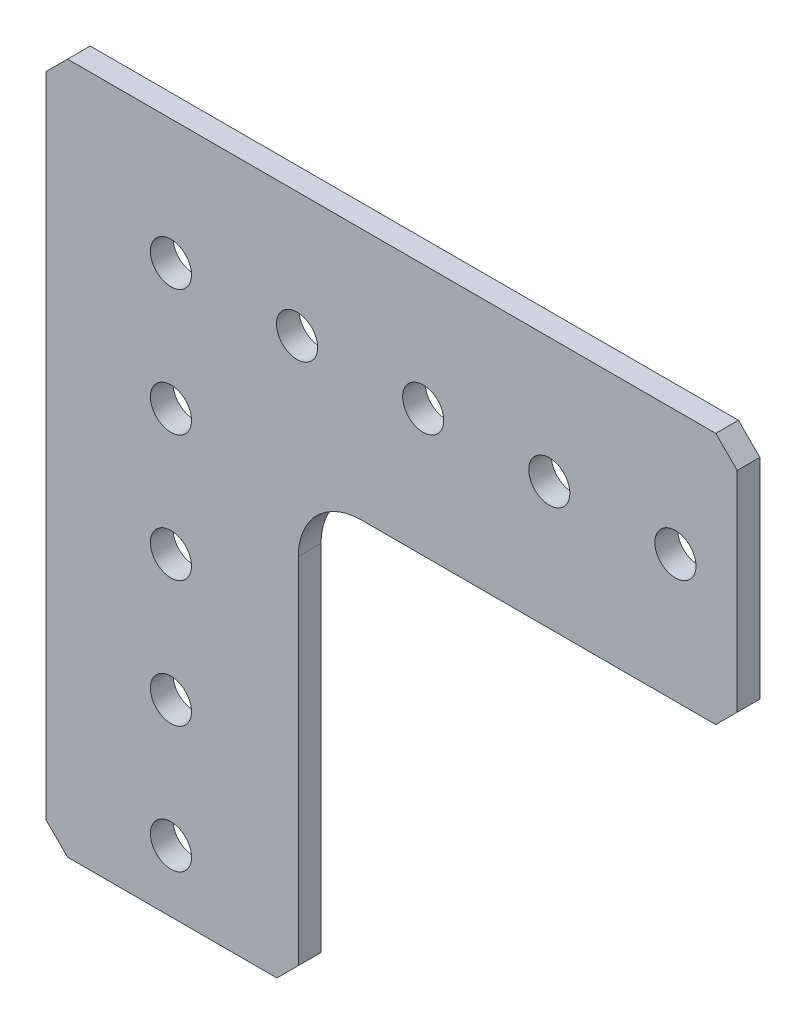
ISO-10303-21;
HEADER;
FILE_DESCRIPTION(('STEP AP214'),'2;1');
FILE_NAME('part.step','',(''),(''),'','','');
FILE_SCHEMA(('AUTOMOTIVE_DESIGN { 1 0 10303 214 1 1 1 1 }'));
ENDSEC;
DATA;
#1=APPLICATION_CONTEXT('core data for automotive mechanical design processes');
#2=APPLICATION_PROTOCOL_DEFINITION('international standard','automotive_design',2000,#1);
#3=PRODUCT_CONTEXT('',#1,'mechanical');
#4=PRODUCT('Part','Part','',(#3));
#5=PRODUCT_RELATED_PRODUCT_CATEGORY('part','',(#4));
#6=PRODUCT_DEFINITION_FORMATION('','',#4);
#7=PRODUCT_DEFINITION_CONTEXT('part definition',#1,'design');
#8=PRODUCT_DEFINITION('design','',#6,#7);
#9=PRODUCT_DEFINITION_SHAPE('','',#8);
#10=(LENGTH_UNIT() NAMED_UNIT(*) SI_UNIT(.MILLI.,.METRE.));
#11=(NAMED_UNIT(*) PLANE_ANGLE_UNIT() SI_UNIT($,.RADIAN.));
#12=(NAMED_UNIT(*) SI_UNIT($,.STERADIAN.) SOLID_ANGLE_UNIT());
#13=UNCERTAINTY_MEASURE_WITH_UNIT(LENGTH_MEASURE(1.E-05),#10,'distance_accuracy_value','');
#14=(GEOMETRIC_REPRESENTATION_CONTEXT(3) GLOBAL_UNCERTAINTY_ASSIGNED_CONTEXT((#13)) GLOBAL_UNIT_ASSIGNED_CONTEXT((#10,
#11,#12)) REPRESENTATION_CONTEXT('',''));
#15=CARTESIAN_POINT('',(0.,0.,0.));
#16=DIRECTION('',(0.,0.,1.));
#17=DIRECTION('',(1.,0.,0.));
#18=AXIS2_PLACEMENT_3D('',#15,#16,#17);
#19=CARTESIAN_POINT('',(-12.573,10.414,2.286));
#20=DIRECTION('',(-0.70710678118655,0.707106781186545,0.));
#21=DIRECTION('',(-0.707106781186545,-0.70710678118655,0.));
#22=AXIS2_PLACEMENT_3D('',#19,#20,#21);
#23=PLANE('',#22);
#24=DIRECTION('',(0.707106781186545,0.70710678118655,0.));
#25=VECTOR('',#24,1.);
#26=CARTESIAN_POINT('',(-12.573,10.414,0.));
#27=LINE('',#26,#25);
#28=CARTESIAN_POINT('',(-12.573,10.414,0.));
#29=VERTEX_POINT('',#28);
#30=CARTESIAN_POINT('',(-10.414,12.573,0.));
#31=VERTEX_POINT('',#30);
#32=EDGE_CURVE('E153',#29,#31,#27,.T.);
#33=ORIENTED_EDGE('',*,*,#32,.F.);
#34=DIRECTION('',(0.,0.,-1.));
#35=VECTOR('',#34,1.);
#36=CARTESIAN_POINT('',(-12.573,10.414,2.286));
#37=LINE('',#36,#35);
#38=CARTESIAN_POINT('',(-12.573,10.414,2.286));
#39=VERTEX_POINT('',#38);
#40=EDGE_CURVE('E11',#39,#29,#37,.T.);
#41=ORIENTED_EDGE('',*,*,#40,.F.);
#42=DIRECTION('',(0.707106781186545,0.70710678118655,0.));
#43=VECTOR('',#42,1.);
#44=CARTESIAN_POINT('',(-12.573,10.414,2.286));
#45=LINE('',#44,#43);
#46=CARTESIAN_POINT('',(-10.414,12.573,2.286));
#47=VERTEX_POINT('',#46);
#48=EDGE_CURVE('E186',#39,#47,#45,.T.);
#49=ORIENTED_EDGE('',*,*,#48,.T.);
#50=DIRECTION('',(0.,0.,-1.));
#51=VECTOR('',#50,1.);
#52=CARTESIAN_POINT('',(-10.414,12.573,2.286));
#53=LINE('',#52,#51);
#54=EDGE_CURVE('E35',#47,#31,#53,.T.);
#55=ORIENTED_EDGE('',*,*,#54,.T.);
#56=EDGE_LOOP('',(#33,#41,#49,#55));
#57=FACE_BOUND('',#56,.T.);
#58=ADVANCED_FACE('F32',(#57),#23,.T.);
#59=CARTESIAN_POINT('',(-12.573,-54.864,2.286));
#60=DIRECTION('',(-1.,0.,0.));
#61=DIRECTION('',(0.,-1.,0.));
#62=AXIS2_PLACEMENT_3D('',#59,#60,#61);
#63=PLANE('',#62);
#64=DIRECTION('',(0.,1.,0.));
#65=VECTOR('',#64,1.);
#66=CARTESIAN_POINT('',(-12.573,-54.864,0.));
#67=LINE('',#66,#65);
#68=CARTESIAN_POINT('',(-12.573,-54.864,0.));
#69=VERTEX_POINT('',#68);
#70=EDGE_CURVE('E184',#69,#29,#67,.T.);
#71=ORIENTED_EDGE('',*,*,#70,.F.);
#72=DIRECTION('',(0.,0.,-1.));
#73=VECTOR('',#72,1.);
#74=CARTESIAN_POINT('',(-12.573,-54.864,2.286));
#75=LINE('',#74,#73);
#76=CARTESIAN_POINT('',(-12.573,-54.864,2.286));
#77=VERTEX_POINT('',#76);
#78=EDGE_CURVE('E41',#77,#69,#75,.T.);
#79=ORIENTED_EDGE('',*,*,#78,.F.);
#80=DIRECTION('',(0.,1.,0.));
#81=VECTOR('',#80,1.);
#82=CARTESIAN_POINT('',(-12.573,-54.864,2.286));
#83=LINE('',#82,#81);
#84=EDGE_CURVE('E143',#77,#39,#83,.T.);
#85=ORIENTED_EDGE('',*,*,#84,.T.);
#86=ORIENTED_EDGE('',*,*,#40,.T.);
#87=EDGE_LOOP('',(#71,#79,#85,#86));
#88=FACE_BOUND('',#87,.T.);
#89=ADVANCED_FACE('F206',(#88),#63,.T.);
#90=CARTESIAN_POINT('',(-10.414,-57.023,2.286));
#91=DIRECTION('',(-0.70710678118654,-0.707106781186555,0.));
#92=DIRECTION('',(0.707106781186555,-0.70710678118654,0.));
#93=AXIS2_PLACEMENT_3D('',#90,#91,#92);
#94=PLANE('',#93);
#95=DIRECTION('',(-0.707106781186555,0.70710678118654,0.));
#96=VECTOR('',#95,1.);
#97=CARTESIAN_POINT('',(-10.414,-57.023,0.));
#98=LINE('',#97,#96);
#99=CARTESIAN_POINT('',(-10.414,-57.023,0.));
#100=VERTEX_POINT('',#99);
#101=EDGE_CURVE('E130',#100,#69,#98,.T.);
#102=ORIENTED_EDGE('',*,*,#101,.F.);
#103=DIRECTION('',(0.,0.,-1.));
#104=VECTOR('',#103,1.);
#105=CARTESIAN_POINT('',(-10.414,-57.023,2.286));
#106=LINE('',#105,#104);
#107=CARTESIAN_POINT('',(-10.414,-57.023,2.286));
#108=VERTEX_POINT('',#107);
#109=EDGE_CURVE('E125',#108,#100,#106,.T.);
#110=ORIENTED_EDGE('',*,*,#109,.F.);
#111=DIRECTION('',(-0.707106781186555,0.70710678118654,0.));
#112=VECTOR('',#111,1.);
#113=CARTESIAN_POINT('',(-10.414,-57.023,2.286));
#114=LINE('',#113,#112);
#115=EDGE_CURVE('E128',#108,#77,#114,.T.);
#116=ORIENTED_EDGE('',*,*,#115,.T.);
#117=ORIENTED_EDGE('',*,*,#78,.T.);
#118=EDGE_LOOP('',(#102,#110,#116,#117));
#119=FACE_BOUND('',#118,.T.);
#120=ADVANCED_FACE('F127',(#119),#94,.T.);
#121=CARTESIAN_POINT('',(10.668,-57.023,2.286));
#122=DIRECTION('',(0.,-1.,0.));
#123=DIRECTION('',(1.,0.,0.));
#124=AXIS2_PLACEMENT_3D('',#121,#122,#123);
#125=PLANE('',#124);
#126=DIRECTION('',(-1.,0.,0.));
#127=VECTOR('',#126,1.);
#128=CARTESIAN_POINT('',(10.668,-57.023,0.));
#129=LINE('',#128,#127);
#130=CARTESIAN_POINT('',(10.668,-57.023,0.));
#131=VERTEX_POINT('',#130);
#132=EDGE_CURVE('E181',#131,#100,#129,.T.);
#133=ORIENTED_EDGE('',*,*,#132,.F.);
#134=DIRECTION('',(0.,0.,-1.));
#135=VECTOR('',#134,1.);
#136=CARTESIAN_POINT('',(10.668,-57.023,2.286));
#137=LINE('',#136,#135);
#138=CARTESIAN_POINT('',(10.668,-57.023,2.286));
#139=VERTEX_POINT('',#138);
#140=EDGE_CURVE('E135',#139,#131,#137,.T.);
#141=ORIENTED_EDGE('',*,*,#140,.F.);
#142=DIRECTION('',(-1.,0.,0.));
#143=VECTOR('',#142,1.);
#144=CARTESIAN_POINT('',(10.668,-57.023,2.286));
#145=LINE('',#144,#143);
#146=EDGE_CURVE('E141',#139,#108,#145,.T.);
#147=ORIENTED_EDGE('',*,*,#146,.T.);
#148=ORIENTED_EDGE('',*,*,#109,.T.);
#149=EDGE_LOOP('',(#133,#141,#147,#148));
#150=FACE_BOUND('',#149,.T.);
#151=ADVANCED_FACE('F145',(#150),#125,.T.);
#152=CARTESIAN_POINT('',(12.827,-54.864,2.286));
#153=DIRECTION('',(0.707106781186551,-0.707106781186544,0.));
#154=DIRECTION('',(0.707106781186544,0.707106781186551,0.));
#155=AXIS2_PLACEMENT_3D('',#152,#153,#154);
#156=PLANE('',#155);
#157=DIRECTION('',(-0.707106781186544,-0.707106781186551,0.));
#158=VECTOR('',#157,1.);
#159=CARTESIAN_POINT('',(12.827,-54.864,0.));
#160=LINE('',#159,#158);
#161=CARTESIAN_POINT('',(12.827,-54.864,0.));
#162=VERTEX_POINT('',#161);
#163=EDGE_CURVE('E178',#162,#131,#160,.T.);
#164=ORIENTED_EDGE('',*,*,#163,.F.);
#165=DIRECTION('',(0.,0.,-1.));
#166=VECTOR('',#165,1.);
#167=CARTESIAN_POINT('',(12.827,-54.864,2.286));
#168=LINE('',#167,#166);
#169=CARTESIAN_POINT('',(12.827,-54.864,2.286));
#170=VERTEX_POINT('',#169);
#171=EDGE_CURVE('E190',#170,#162,#168,.T.);
#172=ORIENTED_EDGE('',*,*,#171,.F.);
#173=DIRECTION('',(-0.707106781186544,-0.707106781186551,0.));
#174=VECTOR('',#173,1.);
#175=CARTESIAN_POINT('',(12.827,-54.864,2.286));
#176=LINE('',#175,#174);
#177=EDGE_CURVE('E146',#170,#139,#176,.T.);
#178=ORIENTED_EDGE('',*,*,#177,.T.);
#179=ORIENTED_EDGE('',*,*,#140,.T.);
#180=EDGE_LOOP('',(#164,#172,#178,#179));
#181=FACE_BOUND('',#180,.T.);
#182=ADVANCED_FACE('F219',(#181),#156,.T.);
#183=CARTESIAN_POINT('',(12.827,-19.177,2.286));
#184=DIRECTION('',(1.,0.,0.));
#185=DIRECTION('',(0.,1.,0.));
#186=AXIS2_PLACEMENT_3D('',#183,#184,#185);
#187=PLANE('',#186);
#188=DIRECTION('',(0.,-1.,0.));
#189=VECTOR('',#188,1.);
#190=CARTESIAN_POINT('',(12.827,-19.177,0.));
#191=LINE('',#190,#189);
#192=CARTESIAN_POINT('',(12.827,-19.177,0.));
#193=VERTEX_POINT('',#192);
#194=EDGE_CURVE('E175',#193,#162,#191,.T.);
#195=ORIENTED_EDGE('',*,*,#194,.F.);
#196=DIRECTION('',(0.,0.,-1.));
#197=VECTOR('',#196,1.);
#198=CARTESIAN_POINT('',(12.827,-19.177,2.286));
#199=LINE('',#198,#197);
#200=CARTESIAN_POINT('',(12.827,-19.177,2.286));
#201=VERTEX_POINT('',#200);
#202=EDGE_CURVE('E192',#201,#193,#199,.T.);
#203=ORIENTED_EDGE('',*,*,#202,.F.);
#204=DIRECTION('',(0.,-1.,0.));
#205=VECTOR('',#204,1.);
#206=CARTESIAN_POINT('',(12.827,-19.177,2.286));
#207=LINE('',#206,#205);
#208=EDGE_CURVE('E148',#201,#170,#207,.T.);
#209=ORIENTED_EDGE('',*,*,#208,.T.);
#210=ORIENTED_EDGE('',*,*,#171,.T.);
#211=EDGE_LOOP('',(#195,#203,#209,#210));
#212=FACE_BOUND('',#211,.T.);
#213=ADVANCED_FACE('F222',(#212),#187,.T.);
#214=CARTESIAN_POINT('',(19.177,-19.177,2.286));
#215=DIRECTION('',(0.,0.,-1.));
#216=DIRECTION('',(-1.,0.,0.));
#217=AXIS2_PLACEMENT_3D('',#214,#215,#216);
#218=CYLINDRICAL_SURFACE('',#217,6.35);
#219=CARTESIAN_POINT('',(19.177,-19.177,0.));
#220=DIRECTION('',(0.,0.,1.));
#221=DIRECTION('',(1.,0.,0.));
#222=AXIS2_PLACEMENT_3D('',#219,#220,#221);
#223=CIRCLE('',#222,6.35);
#224=CARTESIAN_POINT('',(19.177,-12.827,0.));
#225=VERTEX_POINT('',#224);
#226=EDGE_CURVE('E172',#225,#193,#223,.T.);
#227=ORIENTED_EDGE('',*,*,#226,.F.);
#228=DIRECTION('',(0.,0.,-1.));
#229=VECTOR('',#228,1.);
#230=CARTESIAN_POINT('',(19.177,-12.827,2.286));
#231=LINE('',#230,#229);
#232=CARTESIAN_POINT('',(19.177,-12.827,2.286));
#233=VERTEX_POINT('',#232);
#234=EDGE_CURVE('E194',#233,#225,#231,.T.);
#235=ORIENTED_EDGE('',*,*,#234,.F.);
#236=CARTESIAN_POINT('',(19.177,-19.177,2.286));
#237=DIRECTION('',(0.,0.,1.));
#238=DIRECTION('',(1.,0.,0.));
#239=AXIS2_PLACEMENT_3D('',#236,#237,#238);
#240=CIRCLE('',#239,6.35);
#241=EDGE_CURVE('E366',#233,#201,#240,.T.);
#242=ORIENTED_EDGE('',*,*,#241,.T.);
#243=ORIENTED_EDGE('',*,*,#202,.T.);
#244=EDGE_LOOP('',(#227,#235,#242,#243));
#245=FACE_BOUND('',#244,.T.);
#246=ADVANCED_FACE('F226',(#245),#218,.F.);
#247=CARTESIAN_POINT('',(54.864,-12.827,2.286));
#248=DIRECTION('',(0.,-1.,0.));
#249=DIRECTION('',(1.,0.,0.));
#250=AXIS2_PLACEMENT_3D('',#247,#248,#249);
#251=PLANE('',#250);
#252=DIRECTION('',(-1.,0.,0.));
#253=VECTOR('',#252,1.);
#254=CARTESIAN_POINT('',(54.864,-12.827,0.));
#255=LINE('',#254,#253);
#256=CARTESIAN_POINT('',(54.864,-12.827,0.));
#257=VERTEX_POINT('',#256);
#258=EDGE_CURVE('E169',#257,#225,#255,.T.);
#259=ORIENTED_EDGE('',*,*,#258,.F.);
#260=DIRECTION('',(0.,0.,-1.));
#261=VECTOR('',#260,1.);
#262=CARTESIAN_POINT('',(54.864,-12.827,2.286));
#263=LINE('',#262,#261);
#264=CARTESIAN_POINT('',(54.864,-12.827,2.286));
#265=VERTEX_POINT('',#264);
#266=EDGE_CURVE('E196',#265,#257,#263,.T.);
#267=ORIENTED_EDGE('',*,*,#266,.F.);
#268=DIRECTION('',(-1.,0.,0.));
#269=VECTOR('',#268,1.);
#270=CARTESIAN_POINT('',(54.864,-12.827,2.286));
#271=LINE('',#270,#269);
#272=EDGE_CURVE('E363',#265,#233,#271,.T.);
#273=ORIENTED_EDGE('',*,*,#272,.T.);
#274=ORIENTED_EDGE('',*,*,#234,.T.);
#275=EDGE_LOOP('',(#259,#267,#273,#274));
#276=FACE_BOUND('',#275,.T.);
#277=ADVANCED_FACE('F230',(#276),#251,.T.);
#278=CARTESIAN_POINT('',(57.023,-10.668,2.286));
#279=DIRECTION('',(0.707106781186546,-0.707106781186549,0.));
#280=DIRECTION('',(0.707106781186549,0.707106781186546,0.));
#281=AXIS2_PLACEMENT_3D('',#278,#279,#280);
#282=PLANE('',#281);
#283=DIRECTION('',(-0.707106781186549,-0.707106781186546,0.));
#284=VECTOR('',#283,1.);
#285=CARTESIAN_POINT('',(57.023,-10.668,0.));
#286=LINE('',#285,#284);
#287=CARTESIAN_POINT('',(57.023,-10.668,0.));
#288=VERTEX_POINT('',#287);
#289=EDGE_CURVE('E166',#288,#257,#286,.T.);
#290=ORIENTED_EDGE('',*,*,#289,.F.);
#291=DIRECTION('',(0.,0.,-1.));
#292=VECTOR('',#291,1.);
#293=CARTESIAN_POINT('',(57.023,-10.668,2.286));
#294=LINE('',#293,#292);
#295=CARTESIAN_POINT('',(57.023,-10.668,2.286));
#296=VERTEX_POINT('',#295);
#297=EDGE_CURVE('E198',#296,#288,#294,.T.);
#298=ORIENTED_EDGE('',*,*,#297,.F.);
#299=DIRECTION('',(-0.707106781186549,-0.707106781186546,0.));
#300=VECTOR('',#299,1.);
#301=CARTESIAN_POINT('',(57.023,-10.668,2.286));
#302=LINE('',#301,#300);
#303=EDGE_CURVE('E360',#296,#265,#302,.T.);
#304=ORIENTED_EDGE('',*,*,#303,.T.);
#305=ORIENTED_EDGE('',*,*,#266,.T.);
#306=EDGE_LOOP('',(#290,#298,#304,#305));
#307=FACE_BOUND('',#306,.T.);
#308=ADVANCED_FACE('F234',(#307),#282,.T.);
#309=CARTESIAN_POINT('',(57.023,10.414,2.286));
#310=DIRECTION('',(1.,0.,0.));
#311=DIRECTION('',(0.,1.,0.));
#312=AXIS2_PLACEMENT_3D('',#309,#310,#311);
#313=PLANE('',#312);
#314=DIRECTION('',(0.,-1.,0.));
#315=VECTOR('',#314,1.);
#316=CARTESIAN_POINT('',(57.023,10.414,0.));
#317=LINE('',#316,#315);
#318=CARTESIAN_POINT('',(57.023,10.414,0.));
#319=VERTEX_POINT('',#318);
#320=EDGE_CURVE('E163',#319,#288,#317,.T.);
#321=ORIENTED_EDGE('',*,*,#320,.F.);
#322=DIRECTION('',(0.,0.,-1.));
#323=VECTOR('',#322,1.);
#324=CARTESIAN_POINT('',(57.023,10.414,2.286));
#325=LINE('',#324,#323);
#326=CARTESIAN_POINT('',(57.023,10.414,2.286));
#327=VERTEX_POINT('',#326);
#328=EDGE_CURVE('E200',#327,#319,#325,.T.);
#329=ORIENTED_EDGE('',*,*,#328,.F.);
#330=DIRECTION('',(0.,-1.,0.));
#331=VECTOR('',#330,1.);
#332=CARTESIAN_POINT('',(57.023,10.414,2.286));
#333=LINE('',#332,#331);
#334=EDGE_CURVE('E357',#327,#296,#333,.T.);
#335=ORIENTED_EDGE('',*,*,#334,.T.);
#336=ORIENTED_EDGE('',*,*,#297,.T.);
#337=EDGE_LOOP('',(#321,#329,#335,#336));
#338=FACE_BOUND('',#337,.T.);
#339=ADVANCED_FACE('F238',(#338),#313,.T.);
#340=CARTESIAN_POINT('',(54.864,12.573,2.286));
#341=DIRECTION('',(0.707106781186542,0.707106781186554,0.));
#342=DIRECTION('',(-0.707106781186554,0.707106781186542,0.));
#343=AXIS2_PLACEMENT_3D('',#340,#341,#342);
#344=PLANE('',#343);
#345=DIRECTION('',(0.707106781186553,-0.707106781186541,0.));
#346=VECTOR('',#345,1.);
#347=CARTESIAN_POINT('',(54.864,12.573,0.));
#348=LINE('',#347,#346);
#349=CARTESIAN_POINT('',(54.864,12.573,0.));
#350=VERTEX_POINT('',#349);
#351=EDGE_CURVE('E160',#350,#319,#348,.T.);
#352=ORIENTED_EDGE('',*,*,#351,.F.);
#353=DIRECTION('',(0.,0.,-1.));
#354=VECTOR('',#353,1.);
#355=CARTESIAN_POINT('',(54.864,12.573,2.286));
#356=LINE('',#355,#354);
#357=CARTESIAN_POINT('',(54.864,12.573,2.286));
#358=VERTEX_POINT('',#357);
#359=EDGE_CURVE('E201',#358,#350,#356,.T.);
#360=ORIENTED_EDGE('',*,*,#359,.F.);
#361=DIRECTION('',(0.707106781186553,-0.707106781186541,0.));
#362=VECTOR('',#361,1.);
#363=CARTESIAN_POINT('',(54.864,12.573,2.286));
#364=LINE('',#363,#362);
#365=EDGE_CURVE('E354',#358,#327,#364,.T.);
#366=ORIENTED_EDGE('',*,*,#365,.T.);
#367=ORIENTED_EDGE('',*,*,#328,.T.);
#368=EDGE_LOOP('',(#352,#360,#366,#367));
#369=FACE_BOUND('',#368,.T.);
#370=ADVANCED_FACE('F242',(#369),#344,.T.);
#371=CARTESIAN_POINT('',(-10.414,12.573,2.286));
#372=DIRECTION('',(0.,1.,0.));
#373=DIRECTION('',(0.,0.,1.));
#374=AXIS2_PLACEMENT_3D('',#371,#372,#373);
#375=PLANE('',#374);
#376=DIRECTION('',(1.,0.,0.));
#377=VECTOR('',#376,1.);
#378=CARTESIAN_POINT('',(-10.414,12.573,0.));
#379=LINE('',#378,#377);
#380=EDGE_CURVE('E156',#31,#350,#379,.T.);
#381=ORIENTED_EDGE('',*,*,#380,.F.);
#382=ORIENTED_EDGE('',*,*,#54,.F.);
#383=DIRECTION('',(1.,0.,0.));
#384=VECTOR('',#383,1.);
#385=CARTESIAN_POINT('',(-10.414,12.573,2.286));
#386=LINE('',#385,#384);
#387=EDGE_CURVE('E352',#47,#358,#386,.T.);
#388=ORIENTED_EDGE('',*,*,#387,.T.);
#389=ORIENTED_EDGE('',*,*,#359,.T.);
#390=EDGE_LOOP('',(#381,#382,#388,#389));
#391=FACE_BOUND('',#390,.T.);
#392=ADVANCED_FACE('F203',(#391),#375,.T.);
#393=CARTESIAN_POINT('',(19.177,-19.177,2.286));
#394=DIRECTION('',(0.,0.,1.));
#395=DIRECTION('',(1.,0.,0.));
#396=AXIS2_PLACEMENT_3D('',#393,#394,#395);
#397=PLANE('',#396);
#398=CARTESIAN_POINT('',(50.8,0.,2.286));
#399=DIRECTION('',(0.,0.,-1.));
#400=DIRECTION('',(1.,0.,0.));
#401=AXIS2_PLACEMENT_3D('',#398,#399,#400);
#402=CIRCLE('',#401,2.0701);
#403=CARTESIAN_POINT('',(52.8701,0.,2.286));
#404=VERTEX_POINT('',#403);
#405=EDGE_CURVE('E297',#404,#404,#402,.T.);
#406=ORIENTED_EDGE('',*,*,#405,.T.);
#407=EDGE_LOOP('',(#406));
#408=FACE_BOUND('',#407,.T.);
#409=CARTESIAN_POINT('',(3.9907631702977E-13,-38.1,2.286));
#410=DIRECTION('',(0.,0.,-1.));
#411=DIRECTION('',(1.,0.,0.));
#412=AXIS2_PLACEMENT_3D('',#409,#410,#411);
#413=CIRCLE('',#412,2.0701);
#414=CARTESIAN_POINT('',(2.0701000000004,-38.1,2.286));
#415=VERTEX_POINT('',#414);
#416=EDGE_CURVE('E305',#415,#415,#413,.T.);
#417=ORIENTED_EDGE('',*,*,#416,.T.);
#418=EDGE_LOOP('',(#417));
#419=FACE_BOUND('',#418,.T.);
#420=CARTESIAN_POINT('',(1.33025439009923E-13,-12.7,2.286));
#421=DIRECTION('',(0.,0.,-1.));
#422=DIRECTION('',(1.,0.,0.));
#423=AXIS2_PLACEMENT_3D('',#420,#421,#422);
#424=CIRCLE('',#423,2.0701);
#425=CARTESIAN_POINT('',(2.07010000000013,-12.7,2.286));
#426=VERTEX_POINT('',#425);
#427=EDGE_CURVE('E311',#426,#426,#424,.T.);
#428=ORIENTED_EDGE('',*,*,#427,.T.);
#429=EDGE_LOOP('',(#428));
#430=FACE_BOUND('',#429,.T.);
#431=CARTESIAN_POINT('',(25.4,3.54734504026462E-13,2.286));
#432=DIRECTION('',(0.,0.,-1.));
#433=DIRECTION('',(1.,0.,0.));
#434=AXIS2_PLACEMENT_3D('',#431,#432,#433);
#435=CIRCLE('',#434,2.0701);
#436=CARTESIAN_POINT('',(27.4701,3.54734504026462E-13,2.286));
#437=VERTEX_POINT('',#436);
#438=EDGE_CURVE('E317',#437,#437,#435,.T.);
#439=ORIENTED_EDGE('',*,*,#438,.T.);
#440=EDGE_LOOP('',(#439));
#441=FACE_BOUND('',#440,.T.);
#442=CARTESIAN_POINT('',(0.,0.,2.286));
#443=DIRECTION('',(0.,0.,-1.));
#444=DIRECTION('',(1.,0.,0.));
#445=AXIS2_PLACEMENT_3D('',#442,#443,#444);
#446=CIRCLE('',#445,2.0701);
#447=CARTESIAN_POINT('',(2.0701,0.,2.286));
#448=VERTEX_POINT('',#447);
#449=EDGE_CURVE('E323',#448,#448,#446,.T.);
#450=ORIENTED_EDGE('',*,*,#449,.T.);
#451=EDGE_LOOP('',(#450));
#452=FACE_BOUND('',#451,.T.);
#453=CARTESIAN_POINT('',(12.7,1.77367252013231E-13,2.286));
#454=DIRECTION('',(0.,0.,-1.));
#455=DIRECTION('',(1.,0.,0.));
#456=AXIS2_PLACEMENT_3D('',#453,#454,#455);
#457=CIRCLE('',#456,2.0701);
#458=CARTESIAN_POINT('',(14.7701,1.77367252013231E-13,2.286));
#459=VERTEX_POINT('',#458);
#460=EDGE_CURVE('E329',#459,#459,#457,.T.);
#461=ORIENTED_EDGE('',*,*,#460,.T.);
#462=EDGE_LOOP('',(#461));
#463=FACE_BOUND('',#462,.T.);
#464=CARTESIAN_POINT('',(38.1,0.,2.286));
#465=DIRECTION('',(0.,0.,-1.));
#466=DIRECTION('',(1.,0.,0.));
#467=AXIS2_PLACEMENT_3D('',#464,#465,#466);
#468=CIRCLE('',#467,2.0701);
#469=CARTESIAN_POINT('',(40.1701,0.,2.286));
#470=VERTEX_POINT('',#469);
#471=EDGE_CURVE('E335',#470,#470,#468,.T.);
#472=ORIENTED_EDGE('',*,*,#471,.T.);
#473=EDGE_LOOP('',(#472));
#474=FACE_BOUND('',#473,.T.);
#475=CARTESIAN_POINT('',(2.66050878019847E-13,-25.4,2.286));
#476=DIRECTION('',(0.,0.,-1.));
#477=DIRECTION('',(1.,0.,0.));
#478=AXIS2_PLACEMENT_3D('',#475,#476,#477);
#479=CIRCLE('',#478,2.0701);
#480=CARTESIAN_POINT('',(2.07010000000027,-25.4,2.286));
#481=VERTEX_POINT('',#480);
#482=EDGE_CURVE('E341',#481,#481,#479,.T.);
#483=ORIENTED_EDGE('',*,*,#482,.T.);
#484=EDGE_LOOP('',(#483));
#485=FACE_BOUND('',#484,.T.);
#486=CARTESIAN_POINT('',(0.,-50.8,2.286));
#487=DIRECTION('',(0.,0.,-1.));
#488=DIRECTION('',(1.,0.,0.));
#489=AXIS2_PLACEMENT_3D('',#486,#487,#488);
#490=CIRCLE('',#489,2.0701);
#491=CARTESIAN_POINT('',(2.07010000000001,-50.8,2.286));
#492=VERTEX_POINT('',#491);
#493=EDGE_CURVE('E157',#492,#492,#490,.T.);
#494=ORIENTED_EDGE('',*,*,#493,.T.);
#495=EDGE_LOOP('',(#494));
#496=FACE_BOUND('',#495,.T.);
#497=ORIENTED_EDGE('',*,*,#48,.F.);
#498=ORIENTED_EDGE('',*,*,#84,.F.);
#499=ORIENTED_EDGE('',*,*,#115,.F.);
#500=ORIENTED_EDGE('',*,*,#146,.F.);
#501=ORIENTED_EDGE('',*,*,#177,.F.);
#502=ORIENTED_EDGE('',*,*,#208,.F.);
#503=ORIENTED_EDGE('',*,*,#241,.F.);
#504=ORIENTED_EDGE('',*,*,#272,.F.);
#505=ORIENTED_EDGE('',*,*,#303,.F.);
#506=ORIENTED_EDGE('',*,*,#334,.F.);
#507=ORIENTED_EDGE('',*,*,#365,.F.);
#508=ORIENTED_EDGE('',*,*,#387,.F.);
#509=EDGE_LOOP('',(#497,#498,#499,#500,#501,#502,#503,#504,#505,#506,#507,#508));
#510=FACE_BOUND('',#509,.T.);
#511=ADVANCED_FACE('F139',(#408,#419,#430,#441,#452,#463,#474,#485,#496,#510),#397,.T.);
#512=CARTESIAN_POINT('',(19.177,-19.177,0.));
#513=DIRECTION('',(0.,0.,1.));
#514=DIRECTION('',(1.,0.,0.));
#515=AXIS2_PLACEMENT_3D('',#512,#513,#514);
#516=PLANE('',#515);
#517=CARTESIAN_POINT('',(50.8,0.,0.));
#518=DIRECTION('',(0.,0.,-1.));
#519=DIRECTION('',(1.,0.,0.));
#520=AXIS2_PLACEMENT_3D('',#517,#518,#519);
#521=CIRCLE('',#520,2.0701);
#522=CARTESIAN_POINT('',(52.8701,0.,0.));
#523=VERTEX_POINT('',#522);
#524=EDGE_CURVE('E300',#523,#523,#521,.T.);
#525=ORIENTED_EDGE('',*,*,#524,.F.);
#526=EDGE_LOOP('',(#525));
#527=FACE_BOUND('',#526,.T.);
#528=CARTESIAN_POINT('',(3.9907631702977E-13,-38.1,0.));
#529=DIRECTION('',(0.,0.,-1.));
#530=DIRECTION('',(1.,0.,0.));
#531=AXIS2_PLACEMENT_3D('',#528,#529,#530);
#532=CIRCLE('',#531,2.0701);
#533=CARTESIAN_POINT('',(2.0701000000004,-38.1,0.));
#534=VERTEX_POINT('',#533);
#535=EDGE_CURVE('E302',#534,#534,#532,.T.);
#536=ORIENTED_EDGE('',*,*,#535,.F.);
#537=EDGE_LOOP('',(#536));
#538=FACE_BOUND('',#537,.T.);
#539=CARTESIAN_POINT('',(1.33025439009923E-13,-12.7,0.));
#540=DIRECTION('',(0.,0.,-1.));
#541=DIRECTION('',(1.,0.,0.));
#542=AXIS2_PLACEMENT_3D('',#539,#540,#541);
#543=CIRCLE('',#542,2.0701);
#544=CARTESIAN_POINT('',(2.07010000000013,-12.7,0.));
#545=VERTEX_POINT('',#544);
#546=EDGE_CURVE('E308',#545,#545,#543,.T.);
#547=ORIENTED_EDGE('',*,*,#546,.F.);
#548=EDGE_LOOP('',(#547));
#549=FACE_BOUND('',#548,.T.);
#550=CARTESIAN_POINT('',(25.4,3.54734504026462E-13,0.));
#551=DIRECTION('',(0.,0.,-1.));
#552=DIRECTION('',(1.,0.,0.));
#553=AXIS2_PLACEMENT_3D('',#550,#551,#552);
#554=CIRCLE('',#553,2.0701);
#555=CARTESIAN_POINT('',(27.4701,3.54734504026462E-13,0.));
#556=VERTEX_POINT('',#555);
#557=EDGE_CURVE('E314',#556,#556,#554,.T.);
#558=ORIENTED_EDGE('',*,*,#557,.F.);
#559=EDGE_LOOP('',(#558));
#560=FACE_BOUND('',#559,.T.);
#561=CARTESIAN_POINT('',(0.,0.,0.));
#562=DIRECTION('',(0.,0.,-1.));
#563=DIRECTION('',(1.,0.,0.));
#564=AXIS2_PLACEMENT_3D('',#561,#562,#563);
#565=CIRCLE('',#564,2.0701);
#566=CARTESIAN_POINT('',(2.0701,0.,0.));
#567=VERTEX_POINT('',#566);
#568=EDGE_CURVE('E320',#567,#567,#565,.T.);
#569=ORIENTED_EDGE('',*,*,#568,.F.);
#570=EDGE_LOOP('',(#569));
#571=FACE_BOUND('',#570,.T.);
#572=CARTESIAN_POINT('',(12.7,1.77367252013231E-13,0.));
#573=DIRECTION('',(0.,0.,-1.));
#574=DIRECTION('',(1.,0.,0.));
#575=AXIS2_PLACEMENT_3D('',#572,#573,#574);
#576=CIRCLE('',#575,2.0701);
#577=CARTESIAN_POINT('',(14.7701,1.77367252013231E-13,0.));
#578=VERTEX_POINT('',#577);
#579=EDGE_CURVE('E326',#578,#578,#576,.T.);
#580=ORIENTED_EDGE('',*,*,#579,.F.);
#581=EDGE_LOOP('',(#580));
#582=FACE_BOUND('',#581,.T.);
#583=CARTESIAN_POINT('',(38.1,0.,0.));
#584=DIRECTION('',(0.,0.,-1.));
#585=DIRECTION('',(1.,0.,0.));
#586=AXIS2_PLACEMENT_3D('',#583,#584,#585);
#587=CIRCLE('',#586,2.0701);
#588=CARTESIAN_POINT('',(40.1701,0.,0.));
#589=VERTEX_POINT('',#588);
#590=EDGE_CURVE('E332',#589,#589,#587,.T.);
#591=ORIENTED_EDGE('',*,*,#590,.F.);
#592=EDGE_LOOP('',(#591));
#593=FACE_BOUND('',#592,.T.);
#594=CARTESIAN_POINT('',(2.66050878019847E-13,-25.4,0.));
#595=DIRECTION('',(0.,0.,-1.));
#596=DIRECTION('',(1.,0.,0.));
#597=AXIS2_PLACEMENT_3D('',#594,#595,#596);
#598=CIRCLE('',#597,2.0701);
#599=CARTESIAN_POINT('',(2.07010000000027,-25.4,0.));
#600=VERTEX_POINT('',#599);
#601=EDGE_CURVE('E338',#600,#600,#598,.T.);
#602=ORIENTED_EDGE('',*,*,#601,.F.);
#603=EDGE_LOOP('',(#602));
#604=FACE_BOUND('',#603,.T.);
#605=CARTESIAN_POINT('',(0.,-50.8,0.));
#606=DIRECTION('',(0.,0.,-1.));
#607=DIRECTION('',(1.,0.,0.));
#608=AXIS2_PLACEMENT_3D('',#605,#606,#607);
#609=CIRCLE('',#608,2.0701);
#610=CARTESIAN_POINT('',(2.07010000000001,-50.8,0.));
#611=VERTEX_POINT('',#610);
#612=EDGE_CURVE('E344',#611,#611,#609,.T.);
#613=ORIENTED_EDGE('',*,*,#612,.F.);
#614=EDGE_LOOP('',(#613));
#615=FACE_BOUND('',#614,.T.);
#616=ORIENTED_EDGE('',*,*,#32,.T.);
#617=ORIENTED_EDGE('',*,*,#380,.T.);
#618=ORIENTED_EDGE('',*,*,#351,.T.);
#619=ORIENTED_EDGE('',*,*,#320,.T.);
#620=ORIENTED_EDGE('',*,*,#289,.T.);
#621=ORIENTED_EDGE('',*,*,#258,.T.);
#622=ORIENTED_EDGE('',*,*,#226,.T.);
#623=ORIENTED_EDGE('',*,*,#194,.T.);
#624=ORIENTED_EDGE('',*,*,#163,.T.);
#625=ORIENTED_EDGE('',*,*,#132,.T.);
#626=ORIENTED_EDGE('',*,*,#101,.T.);
#627=ORIENTED_EDGE('',*,*,#70,.T.);
#628=EDGE_LOOP('',(#616,#617,#618,#619,#620,#621,#622,#623,#624,#625,#626,#627));
#629=FACE_BOUND('',#628,.T.);
#630=ADVANCED_FACE('F205',(#527,#538,#549,#560,#571,#582,#593,#604,#615,#629),#516,.F.);
#631=CARTESIAN_POINT('',(0.,-50.8,2.286));
#632=DIRECTION('',(0.,0.,-1.));
#633=DIRECTION('',(-1.,0.,0.));
#634=AXIS2_PLACEMENT_3D('',#631,#632,#633);
#635=CYLINDRICAL_SURFACE('',#634,2.0701);
#636=ORIENTED_EDGE('',*,*,#493,.F.);
#637=EDGE_LOOP('',(#636));
#638=FACE_BOUND('',#637,.T.);
#639=ORIENTED_EDGE('',*,*,#612,.T.);
#640=EDGE_LOOP('',(#639));
#641=FACE_BOUND('',#640,.T.);
#642=ADVANCED_FACE('F254',(#638,#641),#635,.F.);
#643=CARTESIAN_POINT('',(2.66050878019847E-13,-25.4,2.286));
#644=DIRECTION('',(0.,0.,-1.));
#645=DIRECTION('',(-1.,0.,0.));
#646=AXIS2_PLACEMENT_3D('',#643,#644,#645);
#647=CYLINDRICAL_SURFACE('',#646,2.0701);
#648=ORIENTED_EDGE('',*,*,#482,.F.);
#649=EDGE_LOOP('',(#648));
#650=FACE_BOUND('',#649,.T.);
#651=ORIENTED_EDGE('',*,*,#601,.T.);
#652=EDGE_LOOP('',(#651));
#653=FACE_BOUND('',#652,.T.);
#654=ADVANCED_FACE('F261',(#650,#653),#647,.F.);
#655=CARTESIAN_POINT('',(38.1,0.,2.286));
#656=DIRECTION('',(0.,0.,-1.));
#657=DIRECTION('',(-1.,0.,0.));
#658=AXIS2_PLACEMENT_3D('',#655,#656,#657);
#659=CYLINDRICAL_SURFACE('',#658,2.0701);
#660=ORIENTED_EDGE('',*,*,#471,.F.);
#661=EDGE_LOOP('',(#660));
#662=FACE_BOUND('',#661,.T.);
#663=ORIENTED_EDGE('',*,*,#590,.T.);
#664=EDGE_LOOP('',(#663));
#665=FACE_BOUND('',#664,.T.);
#666=ADVANCED_FACE('F265',(#662,#665),#659,.F.);
#667=CARTESIAN_POINT('',(12.7,1.77367252013231E-13,2.286));
#668=DIRECTION('',(0.,0.,-1.));
#669=DIRECTION('',(-1.,0.,0.));
#670=AXIS2_PLACEMENT_3D('',#667,#668,#669);
#671=CYLINDRICAL_SURFACE('',#670,2.0701);
#672=ORIENTED_EDGE('',*,*,#460,.F.);
#673=EDGE_LOOP('',(#672));
#674=FACE_BOUND('',#673,.T.);
#675=ORIENTED_EDGE('',*,*,#579,.T.);
#676=EDGE_LOOP('',(#675));
#677=FACE_BOUND('',#676,.T.);
#678=ADVANCED_FACE('F269',(#674,#677),#671,.F.);
#679=CARTESIAN_POINT('',(0.,0.,2.286));
#680=DIRECTION('',(0.,0.,-1.));
#681=DIRECTION('',(-1.,0.,0.));
#682=AXIS2_PLACEMENT_3D('',#679,#680,#681);
#683=CYLINDRICAL_SURFACE('',#682,2.0701);
#684=ORIENTED_EDGE('',*,*,#449,.F.);
#685=EDGE_LOOP('',(#684));
#686=FACE_BOUND('',#685,.T.);
#687=ORIENTED_EDGE('',*,*,#568,.T.);
#688=EDGE_LOOP('',(#687));
#689=FACE_BOUND('',#688,.T.);
#690=ADVANCED_FACE('F273',(#686,#689),#683,.F.);
#691=CARTESIAN_POINT('',(25.4,3.54734504026462E-13,2.286));
#692=DIRECTION('',(0.,0.,-1.));
#693=DIRECTION('',(-1.,0.,0.));
#694=AXIS2_PLACEMENT_3D('',#691,#692,#693);
#695=CYLINDRICAL_SURFACE('',#694,2.0701);
#696=ORIENTED_EDGE('',*,*,#438,.F.);
#697=EDGE_LOOP('',(#696));
#698=FACE_BOUND('',#697,.T.);
#699=ORIENTED_EDGE('',*,*,#557,.T.);
#700=EDGE_LOOP('',(#699));
#701=FACE_BOUND('',#700,.T.);
#702=ADVANCED_FACE('F277',(#698,#701),#695,.F.);
#703=CARTESIAN_POINT('',(1.33025439009923E-13,-12.7,2.286));
#704=DIRECTION('',(0.,0.,-1.));
#705=DIRECTION('',(-1.,0.,0.));
#706=AXIS2_PLACEMENT_3D('',#703,#704,#705);
#707=CYLINDRICAL_SURFACE('',#706,2.0701);
#708=ORIENTED_EDGE('',*,*,#427,.F.);
#709=EDGE_LOOP('',(#708));
#710=FACE_BOUND('',#709,.T.);
#711=ORIENTED_EDGE('',*,*,#546,.T.);
#712=EDGE_LOOP('',(#711));
#713=FACE_BOUND('',#712,.T.);
#714=ADVANCED_FACE('F281',(#710,#713),#707,.F.);
#715=CARTESIAN_POINT('',(3.9907631702977E-13,-38.1,2.286));
#716=DIRECTION('',(0.,0.,-1.));
#717=DIRECTION('',(-1.,0.,0.));
#718=AXIS2_PLACEMENT_3D('',#715,#716,#717);
#719=CYLINDRICAL_SURFACE('',#718,2.0701);
#720=ORIENTED_EDGE('',*,*,#416,.F.);
#721=EDGE_LOOP('',(#720));
#722=FACE_BOUND('',#721,.T.);
#723=ORIENTED_EDGE('',*,*,#535,.T.);
#724=EDGE_LOOP('',(#723));
#725=FACE_BOUND('',#724,.T.);
#726=ADVANCED_FACE('F285',(#722,#725),#719,.F.);
#727=CARTESIAN_POINT('',(50.8,0.,2.286));
#728=DIRECTION('',(0.,0.,-1.));
#729=DIRECTION('',(-1.,0.,0.));
#730=AXIS2_PLACEMENT_3D('',#727,#728,#729);
#731=CYLINDRICAL_SURFACE('',#730,2.0701);
#732=ORIENTED_EDGE('',*,*,#405,.F.);
#733=EDGE_LOOP('',(#732));
#734=FACE_BOUND('',#733,.T.);
#735=ORIENTED_EDGE('',*,*,#524,.T.);
#736=EDGE_LOOP('',(#735));
#737=FACE_BOUND('',#736,.T.);
#738=ADVANCED_FACE('F289',(#734,#737),#731,.F.);
#739=CLOSED_SHELL('',(#58,#89,#120,#151,#182,#213,#246,#277,#308,#339,#370,#392,#511,#630,#642,
#654,#666,#678,#690,#702,#714,#726,#738));
#740=MANIFOLD_SOLID_BREP('B2',#739);
#741=ADVANCED_BREP_SHAPE_REPRESENTATION('',(#18,#740),#14);
#742=SHAPE_DEFINITION_REPRESENTATION(#9,#741);
ENDSEC;
END-ISO-10303-21;
